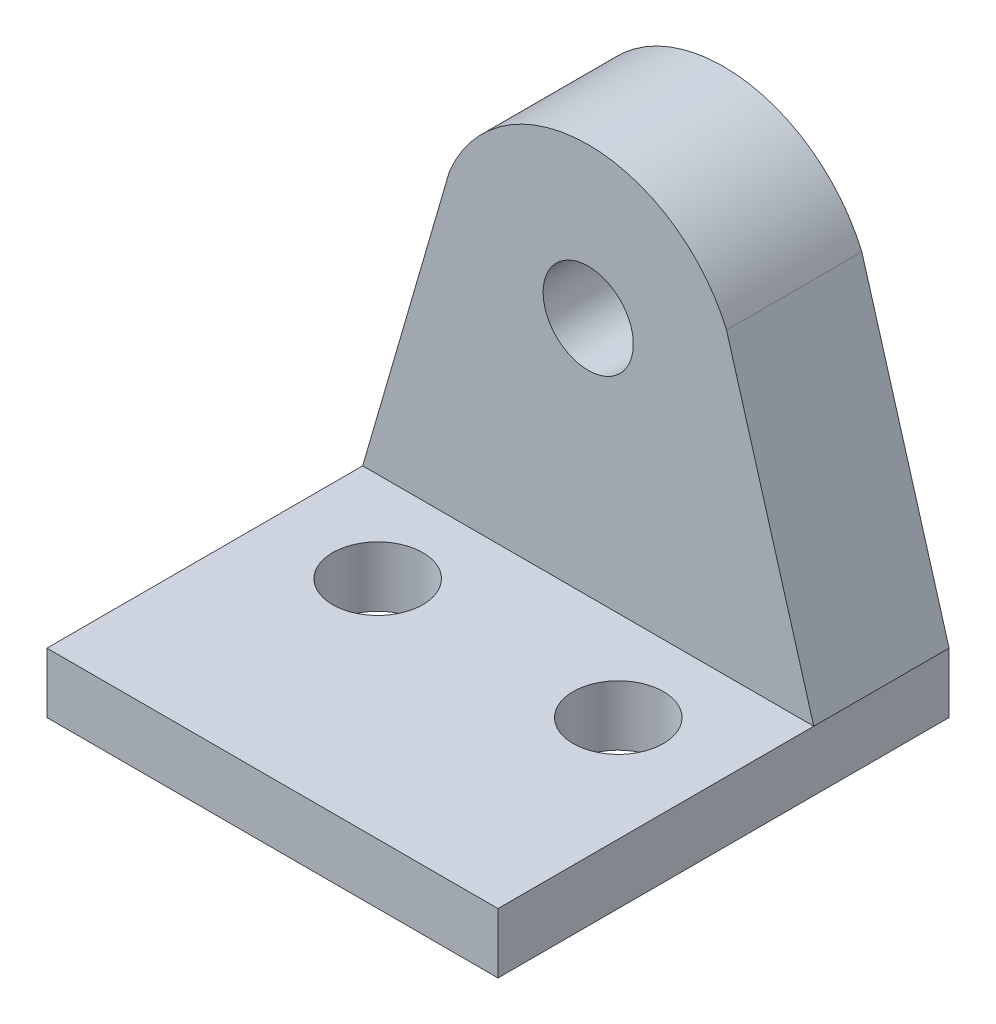
ISO-10303-21;
HEADER;
FILE_DESCRIPTION(('STEP AP214'),'2;1');
FILE_NAME('part.step','',(''),(''),'','','');
FILE_SCHEMA(('AUTOMOTIVE_DESIGN { 1 0 10303 214 1 1 1 1 }'));
ENDSEC;
DATA;
#1=APPLICATION_CONTEXT('core data for automotive mechanical design processes');
#2=APPLICATION_PROTOCOL_DEFINITION('international standard','automotive_design',2000,#1);
#3=PRODUCT_CONTEXT('',#1,'mechanical');
#4=PRODUCT('Part','Part','',(#3));
#5=PRODUCT_RELATED_PRODUCT_CATEGORY('part','',(#4));
#6=PRODUCT_DEFINITION_FORMATION('','',#4);
#7=PRODUCT_DEFINITION_CONTEXT('part definition',#1,'design');
#8=PRODUCT_DEFINITION('design','',#6,#7);
#9=PRODUCT_DEFINITION_SHAPE('','',#8);
#10=(LENGTH_UNIT() NAMED_UNIT(*) SI_UNIT(.MILLI.,.METRE.));
#11=(NAMED_UNIT(*) PLANE_ANGLE_UNIT() SI_UNIT($,.RADIAN.));
#12=(NAMED_UNIT(*) SI_UNIT($,.STERADIAN.) SOLID_ANGLE_UNIT());
#13=UNCERTAINTY_MEASURE_WITH_UNIT(LENGTH_MEASURE(1.E-05),#10,'distance_accuracy_value','');
#14=(GEOMETRIC_REPRESENTATION_CONTEXT(3) GLOBAL_UNCERTAINTY_ASSIGNED_CONTEXT((#13)) GLOBAL_UNIT_ASSIGNED_CONTEXT((#10,
#11,#12)) REPRESENTATION_CONTEXT('',''));
#15=CARTESIAN_POINT('',(0.,0.,0.));
#16=DIRECTION('',(0.,0.,1.));
#17=DIRECTION('',(1.,0.,0.));
#18=AXIS2_PLACEMENT_3D('',#15,#16,#17);
#19=CARTESIAN_POINT('',(7.5,2.,0.));
#20=DIRECTION('',(-1.,0.,0.));
#21=DIRECTION('',(0.,0.,1.));
#22=AXIS2_PLACEMENT_3D('',#19,#20,#21);
#23=PLANE('',#22);
#24=DIRECTION('',(0.,0.,-1.));
#25=VECTOR('',#24,1.);
#26=CARTESIAN_POINT('',(7.5,0.,0.));
#27=LINE('',#26,#25);
#28=CARTESIAN_POINT('',(7.5,0.,15.));
#29=VERTEX_POINT('',#28);
#30=CARTESIAN_POINT('',(7.5,0.,0.));
#31=VERTEX_POINT('',#30);
#32=EDGE_CURVE('E153',#29,#31,#27,.T.);
#33=ORIENTED_EDGE('',*,*,#32,.T.);
#34=DIRECTION('',(0.,-1.,0.));
#35=VECTOR('',#34,1.);
#36=CARTESIAN_POINT('',(7.5,2.,0.));
#37=LINE('',#36,#35);
#38=CARTESIAN_POINT('',(7.5,2.,0.));
#39=VERTEX_POINT('',#38);
#40=EDGE_CURVE('E11',#39,#31,#37,.T.);
#41=ORIENTED_EDGE('',*,*,#40,.F.);
#42=DIRECTION('',(0.,0.,-1.));
#43=VECTOR('',#42,1.);
#44=CARTESIAN_POINT('',(7.5,2.,4.5));
#45=LINE('',#44,#43);
#46=CARTESIAN_POINT('',(7.5,2.,4.5));
#47=VERTEX_POINT('',#46);
#48=EDGE_CURVE('E154',#47,#39,#45,.T.);
#49=ORIENTED_EDGE('',*,*,#48,.F.);
#50=DIRECTION('',(0.,0.,-1.));
#51=VECTOR('',#50,1.);
#52=CARTESIAN_POINT('',(7.5,2.,0.));
#53=LINE('',#52,#51);
#54=CARTESIAN_POINT('',(7.5,2.,15.));
#55=VERTEX_POINT('',#54);
#56=EDGE_CURVE('E103',#55,#47,#53,.T.);
#57=ORIENTED_EDGE('',*,*,#56,.F.);
#58=DIRECTION('',(0.,-1.,0.));
#59=VECTOR('',#58,1.);
#60=CARTESIAN_POINT('',(7.5,2.,15.));
#61=LINE('',#60,#59);
#62=EDGE_CURVE('E114',#55,#29,#61,.T.);
#63=ORIENTED_EDGE('',*,*,#62,.T.);
#64=EDGE_LOOP('',(#33,#41,#49,#57,#63));
#65=FACE_BOUND('',#64,.T.);
#66=ADVANCED_FACE('F33',(#65),#23,.F.);
#67=CARTESIAN_POINT('',(-7.5,2.,0.));
#68=DIRECTION('',(0.,0.,1.));
#69=DIRECTION('',(1.,0.,0.));
#70=AXIS2_PLACEMENT_3D('',#67,#68,#69);
#71=PLANE('',#70);
#72=DIRECTION('',(-1.,0.,0.));
#73=VECTOR('',#72,1.);
#74=CARTESIAN_POINT('',(-7.5,0.,0.));
#75=LINE('',#74,#73);
#76=CARTESIAN_POINT('',(-7.5,0.,0.));
#77=VERTEX_POINT('',#76);
#78=EDGE_CURVE('E54',#31,#77,#75,.T.);
#79=ORIENTED_EDGE('',*,*,#78,.T.);
#80=DIRECTION('',(0.,-1.,0.));
#81=VECTOR('',#80,1.);
#82=CARTESIAN_POINT('',(-7.5,2.,0.));
#83=LINE('',#82,#81);
#84=CARTESIAN_POINT('',(-7.5,2.,0.));
#85=VERTEX_POINT('',#84);
#86=EDGE_CURVE('E40',#85,#77,#83,.T.);
#87=ORIENTED_EDGE('',*,*,#86,.F.);
#88=DIRECTION('',(0.27915208066307,0.960246903593799,0.));
#89=VECTOR('',#88,1.);
#90=CARTESIAN_POINT('',(-4.61502456902073,11.9239408066089,0.));
#91=LINE('',#90,#89);
#92=CARTESIAN_POINT('',(-4.61502456902073,11.9239408066089,0.));
#93=VERTEX_POINT('',#92);
#94=EDGE_CURVE('E138',#85,#93,#91,.T.);
#95=ORIENTED_EDGE('',*,*,#94,.T.);
#96=CARTESIAN_POINT('',(0.,10.,0.));
#97=DIRECTION('',(0.,0.,-1.));
#98=DIRECTION('',(1.,0.,0.));
#99=AXIS2_PLACEMENT_3D('',#96,#97,#98);
#100=CIRCLE('',#99,5.);
#101=CARTESIAN_POINT('',(4.59899134466263,11.9619578516671,0.));
#102=VERTEX_POINT('',#101);
#103=EDGE_CURVE('E131',#93,#102,#100,.T.);
#104=ORIENTED_EDGE('',*,*,#103,.T.);
#105=DIRECTION('',(0.279594733162533,-0.960118110019685,0.));
#106=VECTOR('',#105,1.);
#107=CARTESIAN_POINT('',(4.59899134466263,11.9619578516671,0.));
#108=LINE('',#107,#106);
#109=EDGE_CURVE('E146',#102,#39,#108,.T.);
#110=ORIENTED_EDGE('',*,*,#109,.T.);
#111=ORIENTED_EDGE('',*,*,#40,.T.);
#112=EDGE_LOOP('',(#79,#87,#95,#104,#110,#111));
#113=FACE_BOUND('',#112,.T.);
#114=CARTESIAN_POINT('',(0.,10.,0.));
#115=DIRECTION('',(0.,0.,-1.));
#116=DIRECTION('',(-1.,0.,0.));
#117=AXIS2_PLACEMENT_3D('',#114,#115,#116);
#118=CIRCLE('',#117,1.5);
#119=CARTESIAN_POINT('',(-1.5,10.,0.));
#120=VERTEX_POINT('',#119);
#121=EDGE_CURVE('E113',#120,#120,#118,.T.);
#122=ORIENTED_EDGE('',*,*,#121,.F.);
#123=EDGE_LOOP('',(#122));
#124=FACE_BOUND('',#123,.T.);
#125=ADVANCED_FACE('F170',(#113,#124),#71,.F.);
#126=CARTESIAN_POINT('',(-7.5,2.,7.5));
#127=DIRECTION('',(1.,0.,0.));
#128=DIRECTION('',(0.,0.,-1.));
#129=AXIS2_PLACEMENT_3D('',#126,#127,#128);
#130=PLANE('',#129);
#131=DIRECTION('',(0.,0.,1.));
#132=VECTOR('',#131,1.);
#133=CARTESIAN_POINT('',(-7.5,0.,7.5));
#134=LINE('',#133,#132);
#135=CARTESIAN_POINT('',(-7.5,0.,15.));
#136=VERTEX_POINT('',#135);
#137=EDGE_CURVE('E109',#77,#136,#134,.T.);
#138=ORIENTED_EDGE('',*,*,#137,.T.);
#139=DIRECTION('',(0.,-1.,0.));
#140=VECTOR('',#139,1.);
#141=CARTESIAN_POINT('',(-7.5,2.,15.));
#142=LINE('',#141,#140);
#143=CARTESIAN_POINT('',(-7.5,2.,15.));
#144=VERTEX_POINT('',#143);
#145=EDGE_CURVE('E106',#144,#136,#142,.T.);
#146=ORIENTED_EDGE('',*,*,#145,.F.);
#147=DIRECTION('',(0.,0.,1.));
#148=VECTOR('',#147,1.);
#149=CARTESIAN_POINT('',(-7.5,2.,7.5));
#150=LINE('',#149,#148);
#151=CARTESIAN_POINT('',(-7.5,2.,4.5));
#152=VERTEX_POINT('',#151);
#153=EDGE_CURVE('E93',#152,#144,#150,.T.);
#154=ORIENTED_EDGE('',*,*,#153,.F.);
#155=EDGE_CURVE('E102',#85,#152,#150,.T.);
#156=ORIENTED_EDGE('',*,*,#155,.F.);
#157=ORIENTED_EDGE('',*,*,#86,.T.);
#158=EDGE_LOOP('',(#138,#146,#154,#156,#157));
#159=FACE_BOUND('',#158,.T.);
#160=ADVANCED_FACE('F107',(#159),#130,.F.);
#161=CARTESIAN_POINT('',(0.,2.,0.));
#162=DIRECTION('',(0.,-1.,0.));
#163=DIRECTION('',(0.,0.,-1.));
#164=AXIS2_PLACEMENT_3D('',#161,#162,#163);
#165=PLANE('',#164);
#166=CARTESIAN_POINT('',(-4.,2.,7.5));
#167=DIRECTION('',(0.,-1.,0.));
#168=DIRECTION('',(0.,0.,1.));
#169=AXIS2_PLACEMENT_3D('',#166,#167,#168);
#170=CIRCLE('',#169,1.5);
#171=CARTESIAN_POINT('',(-4.,2.,9.));
#172=VERTEX_POINT('',#171);
#173=EDGE_CURVE('E207',#172,#172,#170,.T.);
#174=ORIENTED_EDGE('',*,*,#173,.T.);
#175=EDGE_LOOP('',(#174));
#176=FACE_BOUND('',#175,.T.);
#177=CARTESIAN_POINT('',(4.,2.,7.5));
#178=DIRECTION('',(0.,1.,0.));
#179=DIRECTION('',(0.,0.,1.));
#180=AXIS2_PLACEMENT_3D('',#177,#178,#179);
#181=CIRCLE('',#180,1.5);
#182=CARTESIAN_POINT('',(4.,2.,9.));
#183=VERTEX_POINT('',#182);
#184=EDGE_CURVE('E125',#183,#183,#181,.T.);
#185=ORIENTED_EDGE('',*,*,#184,.F.);
#186=EDGE_LOOP('',(#185));
#187=FACE_BOUND('',#186,.T.);
#188=ORIENTED_EDGE('',*,*,#56,.T.);
#189=DIRECTION('',(-1.,0.,0.));
#190=VECTOR('',#189,1.);
#191=CARTESIAN_POINT('',(7.5,2.,4.5));
#192=LINE('',#191,#190);
#193=EDGE_CURVE('E99',#47,#152,#192,.T.);
#194=ORIENTED_EDGE('',*,*,#193,.T.);
#195=ORIENTED_EDGE('',*,*,#153,.T.);
#196=DIRECTION('',(-1.,0.,0.));
#197=VECTOR('',#196,1.);
#198=CARTESIAN_POINT('',(-7.5,2.,15.));
#199=LINE('',#198,#197);
#200=EDGE_CURVE('E98',#55,#144,#199,.T.);
#201=ORIENTED_EDGE('',*,*,#200,.F.);
#202=EDGE_LOOP('',(#188,#194,#195,#201));
#203=FACE_BOUND('',#202,.T.);
#204=ADVANCED_FACE('F96',(#176,#187,#203),#165,.F.);
#205=CARTESIAN_POINT('',(0.,0.,0.));
#206=DIRECTION('',(0.,-1.,0.));
#207=DIRECTION('',(0.,0.,-1.));
#208=AXIS2_PLACEMENT_3D('',#205,#206,#207);
#209=PLANE('',#208);
#210=CARTESIAN_POINT('',(-4.,0.,7.5));
#211=DIRECTION('',(0.,-1.,0.));
#212=DIRECTION('',(0.,0.,1.));
#213=AXIS2_PLACEMENT_3D('',#210,#211,#212);
#214=CIRCLE('',#213,1.5);
#215=CARTESIAN_POINT('',(-4.,0.,9.));
#216=VERTEX_POINT('',#215);
#217=EDGE_CURVE('E211',#216,#216,#214,.T.);
#218=ORIENTED_EDGE('',*,*,#217,.F.);
#219=EDGE_LOOP('',(#218));
#220=FACE_BOUND('',#219,.T.);
#221=CARTESIAN_POINT('',(4.,0.,7.5));
#222=DIRECTION('',(0.,1.,0.));
#223=DIRECTION('',(0.,0.,1.));
#224=AXIS2_PLACEMENT_3D('',#221,#222,#223);
#225=CIRCLE('',#224,1.5);
#226=CARTESIAN_POINT('',(4.,0.,9.));
#227=VERTEX_POINT('',#226);
#228=EDGE_CURVE('E122',#227,#227,#225,.T.);
#229=ORIENTED_EDGE('',*,*,#228,.T.);
#230=EDGE_LOOP('',(#229));
#231=FACE_BOUND('',#230,.T.);
#232=ORIENTED_EDGE('',*,*,#32,.F.);
#233=DIRECTION('',(-1.,0.,0.));
#234=VECTOR('',#233,1.);
#235=CARTESIAN_POINT('',(-7.5,0.,15.));
#236=LINE('',#235,#234);
#237=EDGE_CURVE('E119',#29,#136,#236,.T.);
#238=ORIENTED_EDGE('',*,*,#237,.T.);
#239=ORIENTED_EDGE('',*,*,#137,.F.);
#240=ORIENTED_EDGE('',*,*,#78,.F.);
#241=EDGE_LOOP('',(#232,#238,#239,#240));
#242=FACE_BOUND('',#241,.T.);
#243=ADVANCED_FACE('F162',(#220,#231,#242),#209,.T.);
#244=CARTESIAN_POINT('',(0.,10.,4.5));
#245=DIRECTION('',(0.,0.,-1.));
#246=DIRECTION('',(-1.,0.,0.));
#247=AXIS2_PLACEMENT_3D('',#244,#245,#246);
#248=CYLINDRICAL_SURFACE('',#247,5.);
#249=ORIENTED_EDGE('',*,*,#103,.F.);
#250=DIRECTION('',(0.,0.,-1.));
#251=VECTOR('',#250,1.);
#252=CARTESIAN_POINT('',(-4.61502456902073,11.9239408066089,4.5));
#253=LINE('',#252,#251);
#254=CARTESIAN_POINT('',(-4.61502456902073,11.9239408066089,4.5));
#255=VERTEX_POINT('',#254);
#256=EDGE_CURVE('E151',#255,#93,#253,.T.);
#257=ORIENTED_EDGE('',*,*,#256,.F.);
#258=CARTESIAN_POINT('',(0.,10.,4.5));
#259=DIRECTION('',(0.,0.,-1.));
#260=DIRECTION('',(1.,0.,0.));
#261=AXIS2_PLACEMENT_3D('',#258,#259,#260);
#262=CIRCLE('',#261,5.);
#263=CARTESIAN_POINT('',(4.59899134466263,11.9619578516671,4.5));
#264=VERTEX_POINT('',#263);
#265=EDGE_CURVE('E134',#255,#264,#262,.T.);
#266=ORIENTED_EDGE('',*,*,#265,.T.);
#267=DIRECTION('',(0.,0.,-1.));
#268=VECTOR('',#267,1.);
#269=CARTESIAN_POINT('',(4.59899134466263,11.9619578516671,4.5));
#270=LINE('',#269,#268);
#271=EDGE_CURVE('E143',#264,#102,#270,.T.);
#272=ORIENTED_EDGE('',*,*,#271,.T.);
#273=EDGE_LOOP('',(#249,#257,#266,#272));
#274=FACE_BOUND('',#273,.T.);
#275=ADVANCED_FACE('F174',(#274),#248,.T.);
#276=CARTESIAN_POINT('',(-4.61502456902073,11.9239408066089,4.5));
#277=DIRECTION('',(-0.960246903593799,0.27915208066307,0.));
#278=DIRECTION('',(-0.27915208066307,-0.960246903593799,0.));
#279=AXIS2_PLACEMENT_3D('',#276,#277,#278);
#280=PLANE('',#279);
#281=ORIENTED_EDGE('',*,*,#94,.F.);
#282=ORIENTED_EDGE('',*,*,#155,.T.);
#283=DIRECTION('',(0.27915208066307,0.960246903593799,0.));
#284=VECTOR('',#283,1.);
#285=CARTESIAN_POINT('',(-4.61502456902073,11.9239408066089,4.5));
#286=LINE('',#285,#284);
#287=EDGE_CURVE('E47',#152,#255,#286,.T.);
#288=ORIENTED_EDGE('',*,*,#287,.T.);
#289=ORIENTED_EDGE('',*,*,#256,.T.);
#290=EDGE_LOOP('',(#281,#282,#288,#289));
#291=FACE_BOUND('',#290,.T.);
#292=ADVANCED_FACE('F177',(#291),#280,.T.);
#293=CARTESIAN_POINT('',(4.59899134466263,11.9619578516671,4.5));
#294=DIRECTION('',(0.960118110019685,0.279594733162533,0.));
#295=DIRECTION('',(-0.279594733162533,0.960118110019685,0.));
#296=AXIS2_PLACEMENT_3D('',#293,#294,#295);
#297=PLANE('',#296);
#298=ORIENTED_EDGE('',*,*,#109,.F.);
#299=ORIENTED_EDGE('',*,*,#271,.F.);
#300=DIRECTION('',(0.279594733162533,-0.960118110019685,0.));
#301=VECTOR('',#300,1.);
#302=CARTESIAN_POINT('',(4.59899134466263,11.9619578516671,4.5));
#303=LINE('',#302,#301);
#304=EDGE_CURVE('E137',#264,#47,#303,.T.);
#305=ORIENTED_EDGE('',*,*,#304,.T.);
#306=ORIENTED_EDGE('',*,*,#48,.T.);
#307=EDGE_LOOP('',(#298,#299,#305,#306));
#308=FACE_BOUND('',#307,.T.);
#309=ADVANCED_FACE('F168',(#308),#297,.T.);
#310=CARTESIAN_POINT('',(0.,10.,4.5));
#311=DIRECTION('',(0.,0.,1.));
#312=DIRECTION('',(1.,0.,0.));
#313=AXIS2_PLACEMENT_3D('',#310,#311,#312);
#314=PLANE('',#313);
#315=CARTESIAN_POINT('',(0.,10.,4.5));
#316=DIRECTION('',(0.,0.,-1.));
#317=DIRECTION('',(-1.,0.,0.));
#318=AXIS2_PLACEMENT_3D('',#315,#316,#317);
#319=CIRCLE('',#318,1.5);
#320=CARTESIAN_POINT('',(-1.5,10.,4.5));
#321=VERTEX_POINT('',#320);
#322=EDGE_CURVE('E128',#321,#321,#319,.T.);
#323=ORIENTED_EDGE('',*,*,#322,.T.);
#324=EDGE_LOOP('',(#323));
#325=FACE_BOUND('',#324,.T.);
#326=ORIENTED_EDGE('',*,*,#265,.F.);
#327=ORIENTED_EDGE('',*,*,#287,.F.);
#328=ORIENTED_EDGE('',*,*,#193,.F.);
#329=ORIENTED_EDGE('',*,*,#304,.F.);
#330=EDGE_LOOP('',(#326,#327,#328,#329));
#331=FACE_BOUND('',#330,.T.);
#332=ADVANCED_FACE('F175',(#325,#331),#314,.T.);
#333=CARTESIAN_POINT('',(0.,10.,4.5));
#334=DIRECTION('',(0.,0.,-1.));
#335=DIRECTION('',(-1.,0.,0.));
#336=AXIS2_PLACEMENT_3D('',#333,#334,#335);
#337=CYLINDRICAL_SURFACE('',#336,1.5);
#338=ORIENTED_EDGE('',*,*,#322,.F.);
#339=EDGE_LOOP('',(#338));
#340=FACE_BOUND('',#339,.T.);
#341=ORIENTED_EDGE('',*,*,#121,.T.);
#342=EDGE_LOOP('',(#341));
#343=FACE_BOUND('',#342,.T.);
#344=ADVANCED_FACE('F231',(#340,#343),#337,.F.);
#345=CARTESIAN_POINT('',(-7.5,2.,15.));
#346=DIRECTION('',(0.,0.,1.));
#347=DIRECTION('',(1.,0.,0.));
#348=AXIS2_PLACEMENT_3D('',#345,#346,#347);
#349=PLANE('',#348);
#350=ORIENTED_EDGE('',*,*,#237,.F.);
#351=ORIENTED_EDGE('',*,*,#62,.F.);
#352=ORIENTED_EDGE('',*,*,#200,.T.);
#353=ORIENTED_EDGE('',*,*,#145,.T.);
#354=EDGE_LOOP('',(#350,#351,#352,#353));
#355=FACE_BOUND('',#354,.T.);
#356=ADVANCED_FACE('F117',(#355),#349,.T.);
#357=CARTESIAN_POINT('',(4.,0.,7.5));
#358=DIRECTION('',(0.,1.,0.));
#359=DIRECTION('',(0.,0.,1.));
#360=AXIS2_PLACEMENT_3D('',#357,#358,#359);
#361=CYLINDRICAL_SURFACE('',#360,1.5);
#362=ORIENTED_EDGE('',*,*,#228,.F.);
#363=EDGE_LOOP('',(#362));
#364=FACE_BOUND('',#363,.T.);
#365=ORIENTED_EDGE('',*,*,#184,.T.);
#366=EDGE_LOOP('',(#365));
#367=FACE_BOUND('',#366,.T.);
#368=ADVANCED_FACE('F223',(#364,#367),#361,.F.);
#369=CARTESIAN_POINT('',(-4.,0.,7.5));
#370=DIRECTION('',(0.,1.,0.));
#371=DIRECTION('',(0.,0.,1.));
#372=AXIS2_PLACEMENT_3D('',#369,#370,#371);
#373=CYLINDRICAL_SURFACE('',#372,1.5);
#374=ORIENTED_EDGE('',*,*,#217,.T.);
#375=EDGE_LOOP('',(#374));
#376=FACE_BOUND('',#375,.T.);
#377=ORIENTED_EDGE('',*,*,#173,.F.);
#378=EDGE_LOOP('',(#377));
#379=FACE_BOUND('',#378,.T.);
#380=ADVANCED_FACE('F218',(#376,#379),#373,.F.);
#381=CLOSED_SHELL('',(#66,#125,#160,#204,#243,#275,#292,#309,#332,#344,#356,#368,#380));
#382=MANIFOLD_SOLID_BREP('B2',#381);
#383=ADVANCED_BREP_SHAPE_REPRESENTATION('',(#18,#382),#14);
#384=SHAPE_DEFINITION_REPRESENTATION(#9,#383);
ENDSEC;
END-ISO-10303-21;
